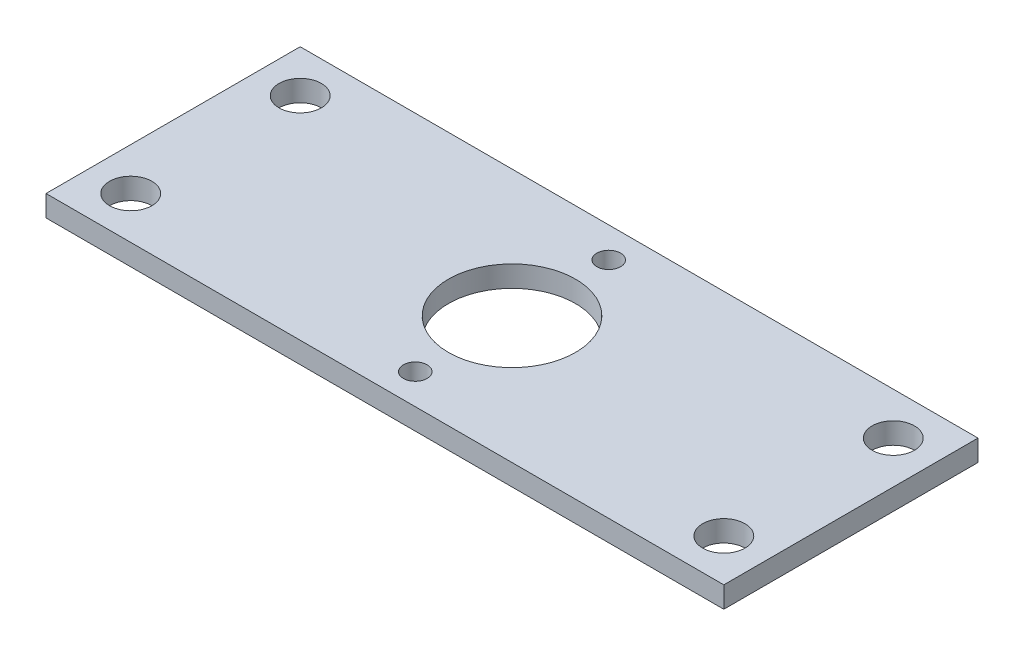
ISO-10303-21;
HEADER;
FILE_DESCRIPTION(('STEP AP214'),'2;1');
FILE_NAME('part.step','',(''),(''),'','','');
FILE_SCHEMA(('AUTOMOTIVE_DESIGN { 1 0 10303 214 1 1 1 1 }'));
ENDSEC;
DATA;
#1=APPLICATION_CONTEXT('core data for automotive mechanical design processes');
#2=APPLICATION_PROTOCOL_DEFINITION('international standard','automotive_design',2000,#1);
#3=PRODUCT_CONTEXT('',#1,'mechanical');
#4=PRODUCT('Part','Part','',(#3));
#5=PRODUCT_RELATED_PRODUCT_CATEGORY('part','',(#4));
#6=PRODUCT_DEFINITION_FORMATION('','',#4);
#7=PRODUCT_DEFINITION_CONTEXT('part definition',#1,'design');
#8=PRODUCT_DEFINITION('design','',#6,#7);
#9=PRODUCT_DEFINITION_SHAPE('','',#8);
#10=(LENGTH_UNIT() NAMED_UNIT(*) SI_UNIT(.MILLI.,.METRE.));
#11=(NAMED_UNIT(*) PLANE_ANGLE_UNIT() SI_UNIT($,.RADIAN.));
#12=(NAMED_UNIT(*) SI_UNIT($,.STERADIAN.) SOLID_ANGLE_UNIT());
#13=UNCERTAINTY_MEASURE_WITH_UNIT(LENGTH_MEASURE(1.E-05),#10,'distance_accuracy_value','');
#14=(GEOMETRIC_REPRESENTATION_CONTEXT(3) GLOBAL_UNCERTAINTY_ASSIGNED_CONTEXT((#13)) GLOBAL_UNIT_ASSIGNED_CONTEXT((#10,
#11,#12)) REPRESENTATION_CONTEXT('',''));
#15=CARTESIAN_POINT('',(0.,0.,0.));
#16=DIRECTION('',(0.,0.,1.));
#17=DIRECTION('',(1.,0.,0.));
#18=AXIS2_PLACEMENT_3D('',#15,#16,#17);
#19=CARTESIAN_POINT('',(-12.7,3.175,-19.05));
#20=DIRECTION('',(0.,0.,1.));
#21=DIRECTION('',(1.,0.,0.));
#22=AXIS2_PLACEMENT_3D('',#19,#20,#21);
#23=PLANE('',#22);
#24=DIRECTION('',(-1.,0.,0.));
#25=VECTOR('',#24,1.);
#26=CARTESIAN_POINT('',(-12.7,0.,-19.05));
#27=LINE('',#26,#25);
#28=CARTESIAN_POINT('',(50.8,0.,-19.05));
#29=VERTEX_POINT('',#28);
#30=CARTESIAN_POINT('',(-50.8,0.,-19.05));
#31=VERTEX_POINT('',#30);
#32=EDGE_CURVE('E81',#29,#31,#27,.T.);
#33=ORIENTED_EDGE('',*,*,#32,.T.);
#34=DIRECTION('',(0.,-1.,0.));
#35=VECTOR('',#34,1.);
#36=CARTESIAN_POINT('',(-50.8,0.,-19.05));
#37=LINE('',#36,#35);
#38=CARTESIAN_POINT('',(-50.8,3.175,-19.05));
#39=VERTEX_POINT('',#38);
#40=EDGE_CURVE('E102',#39,#31,#37,.T.);
#41=ORIENTED_EDGE('',*,*,#40,.F.);
#42=DIRECTION('',(-1.,0.,0.));
#43=VECTOR('',#42,1.);
#44=CARTESIAN_POINT('',(-12.7,3.175,-19.05));
#45=LINE('',#44,#43);
#46=CARTESIAN_POINT('',(50.8,3.175,-19.05));
#47=VERTEX_POINT('',#46);
#48=EDGE_CURVE('E43',#47,#39,#45,.T.);
#49=ORIENTED_EDGE('',*,*,#48,.F.);
#50=DIRECTION('',(0.,1.,0.));
#51=VECTOR('',#50,1.);
#52=CARTESIAN_POINT('',(50.8,0.,-19.05));
#53=LINE('',#52,#51);
#54=EDGE_CURVE('E88',#29,#47,#53,.T.);
#55=ORIENTED_EDGE('',*,*,#54,.F.);
#56=EDGE_LOOP('',(#33,#41,#49,#55));
#57=FACE_BOUND('',#56,.T.);
#58=ADVANCED_FACE('F35',(#57),#23,.F.);
#59=CARTESIAN_POINT('',(-12.7,3.175,19.05));
#60=DIRECTION('',(0.,0.,-1.));
#61=DIRECTION('',(-1.,0.,0.));
#62=AXIS2_PLACEMENT_3D('',#59,#60,#61);
#63=PLANE('',#62);
#64=DIRECTION('',(1.,0.,0.));
#65=VECTOR('',#64,1.);
#66=CARTESIAN_POINT('',(-12.7,0.,19.05));
#67=LINE('',#66,#65);
#68=CARTESIAN_POINT('',(-50.8,0.,19.05));
#69=VERTEX_POINT('',#68);
#70=CARTESIAN_POINT('',(50.8,0.,19.05));
#71=VERTEX_POINT('',#70);
#72=EDGE_CURVE('E38',#69,#71,#67,.T.);
#73=ORIENTED_EDGE('',*,*,#72,.T.);
#74=DIRECTION('',(0.,-1.,0.));
#75=VECTOR('',#74,1.);
#76=CARTESIAN_POINT('',(50.8,0.,19.05));
#77=LINE('',#76,#75);
#78=CARTESIAN_POINT('',(50.8,3.175,19.05));
#79=VERTEX_POINT('',#78);
#80=EDGE_CURVE('E76',#79,#71,#77,.T.);
#81=ORIENTED_EDGE('',*,*,#80,.F.);
#82=DIRECTION('',(1.,0.,0.));
#83=VECTOR('',#82,1.);
#84=CARTESIAN_POINT('',(-12.7,3.175,19.05));
#85=LINE('',#84,#83);
#86=CARTESIAN_POINT('',(-50.8,3.175,19.05));
#87=VERTEX_POINT('',#86);
#88=EDGE_CURVE('E11',#87,#79,#85,.T.);
#89=ORIENTED_EDGE('',*,*,#88,.F.);
#90=DIRECTION('',(0.,1.,0.));
#91=VECTOR('',#90,1.);
#92=CARTESIAN_POINT('',(-50.8,0.,19.05));
#93=LINE('',#92,#91);
#94=EDGE_CURVE('E77',#69,#87,#93,.T.);
#95=ORIENTED_EDGE('',*,*,#94,.F.);
#96=EDGE_LOOP('',(#73,#81,#89,#95));
#97=FACE_BOUND('',#96,.T.);
#98=ADVANCED_FACE('F74',(#97),#63,.F.);
#99=CARTESIAN_POINT('',(0.,3.175,0.));
#100=DIRECTION('',(0.,1.,0.));
#101=DIRECTION('',(0.,0.,1.));
#102=AXIS2_PLACEMENT_3D('',#99,#100,#101);
#103=PLANE('',#102);
#104=CARTESIAN_POINT('',(-44.45,3.175,12.7));
#105=DIRECTION('',(0.,1.,0.));
#106=DIRECTION('',(0.,0.,1.));
#107=AXIS2_PLACEMENT_3D('',#104,#105,#106);
#108=CIRCLE('',#107,3.175);
#109=CARTESIAN_POINT('',(-44.45,3.175,15.875));
#110=VERTEX_POINT('',#109);
#111=EDGE_CURVE('E297',#110,#110,#108,.T.);
#112=ORIENTED_EDGE('',*,*,#111,.F.);
#113=EDGE_LOOP('',(#112));
#114=FACE_BOUND('',#113,.T.);
#115=CARTESIAN_POINT('',(44.45,3.175,12.7));
#116=DIRECTION('',(0.,1.,0.));
#117=DIRECTION('',(0.,0.,1.));
#118=AXIS2_PLACEMENT_3D('',#115,#116,#117);
#119=CIRCLE('',#118,3.175);
#120=CARTESIAN_POINT('',(44.45,3.175,15.875));
#121=VERTEX_POINT('',#120);
#122=EDGE_CURVE('E302',#121,#121,#119,.T.);
#123=ORIENTED_EDGE('',*,*,#122,.F.);
#124=EDGE_LOOP('',(#123));
#125=FACE_BOUND('',#124,.T.);
#126=CARTESIAN_POINT('',(44.45,3.175,-12.7));
#127=DIRECTION('',(0.,1.,0.));
#128=DIRECTION('',(0.,0.,1.));
#129=AXIS2_PLACEMENT_3D('',#126,#127,#128);
#130=CIRCLE('',#129,3.175);
#131=CARTESIAN_POINT('',(44.45,3.175,-9.52499999999997));
#132=VERTEX_POINT('',#131);
#133=EDGE_CURVE('E310',#132,#132,#130,.T.);
#134=ORIENTED_EDGE('',*,*,#133,.F.);
#135=EDGE_LOOP('',(#134));
#136=FACE_BOUND('',#135,.T.);
#137=CARTESIAN_POINT('',(-44.45,3.175,-12.7));
#138=DIRECTION('',(0.,1.,0.));
#139=DIRECTION('',(0.,0.,1.));
#140=AXIS2_PLACEMENT_3D('',#137,#138,#139);
#141=CIRCLE('',#140,3.175);
#142=CARTESIAN_POINT('',(-44.45,3.175,-9.52499999999997));
#143=VERTEX_POINT('',#142);
#144=EDGE_CURVE('E96',#143,#143,#141,.T.);
#145=ORIENTED_EDGE('',*,*,#144,.F.);
#146=EDGE_LOOP('',(#145));
#147=FACE_BOUND('',#146,.T.);
#148=CARTESIAN_POINT('',(0.,3.175,14.5000000000001));
#149=DIRECTION('',(0.,1.,0.));
#150=DIRECTION('',(0.,0.,1.));
#151=AXIS2_PLACEMENT_3D('',#148,#149,#150);
#152=CIRCLE('',#151,1.77800000000003);
#153=CARTESIAN_POINT('',(0.,3.175,16.2780000000001));
#154=VERTEX_POINT('',#153);
#155=EDGE_CURVE('E115',#154,#154,#152,.T.);
#156=ORIENTED_EDGE('',*,*,#155,.F.);
#157=EDGE_LOOP('',(#156));
#158=FACE_BOUND('',#157,.T.);
#159=CARTESIAN_POINT('',(0.,3.175,-14.5));
#160=DIRECTION('',(0.,1.,0.));
#161=DIRECTION('',(0.,0.,1.));
#162=AXIS2_PLACEMENT_3D('',#159,#160,#161);
#163=CIRCLE('',#162,1.778);
#164=CARTESIAN_POINT('',(0.,3.175,-12.722));
#165=VERTEX_POINT('',#164);
#166=EDGE_CURVE('E110',#165,#165,#163,.T.);
#167=ORIENTED_EDGE('',*,*,#166,.F.);
#168=EDGE_LOOP('',(#167));
#169=FACE_BOUND('',#168,.T.);
#170=CARTESIAN_POINT('',(0.,3.175,0.));
#171=DIRECTION('',(0.,1.,0.));
#172=DIRECTION('',(0.,0.,1.));
#173=AXIS2_PLACEMENT_3D('',#170,#171,#172);
#174=CIRCLE('',#173,9.525);
#175=CARTESIAN_POINT('',(0.,3.175,9.525));
#176=VERTEX_POINT('',#175);
#177=EDGE_CURVE('E114',#176,#176,#174,.T.);
#178=ORIENTED_EDGE('',*,*,#177,.F.);
#179=EDGE_LOOP('',(#178));
#180=FACE_BOUND('',#179,.T.);
#181=ORIENTED_EDGE('',*,*,#88,.T.);
#182=DIRECTION('',(0.,0.,1.));
#183=VECTOR('',#182,1.);
#184=CARTESIAN_POINT('',(50.8,3.175,19.05));
#185=LINE('',#184,#183);
#186=EDGE_CURVE('E92',#47,#79,#185,.T.);
#187=ORIENTED_EDGE('',*,*,#186,.F.);
#188=ORIENTED_EDGE('',*,*,#48,.T.);
#189=DIRECTION('',(0.,0.,-1.));
#190=VECTOR('',#189,1.);
#191=CARTESIAN_POINT('',(-50.8,3.175,-19.05));
#192=LINE('',#191,#190);
#193=EDGE_CURVE('E108',#87,#39,#192,.T.);
#194=ORIENTED_EDGE('',*,*,#193,.F.);
#195=EDGE_LOOP('',(#181,#187,#188,#194));
#196=FACE_BOUND('',#195,.T.);
#197=ADVANCED_FACE('F132',(#114,#125,#136,#147,#158,#169,#180,#196),#103,.T.);
#198=CARTESIAN_POINT('',(0.,0.,0.));
#199=DIRECTION('',(0.,1.,0.));
#200=DIRECTION('',(0.,0.,1.));
#201=AXIS2_PLACEMENT_3D('',#198,#199,#200);
#202=PLANE('',#201);
#203=CARTESIAN_POINT('',(-44.45,0.,12.7));
#204=DIRECTION('',(0.,1.,0.));
#205=DIRECTION('',(0.,0.,1.));
#206=AXIS2_PLACEMENT_3D('',#203,#204,#205);
#207=CIRCLE('',#206,3.175);
#208=CARTESIAN_POINT('',(-44.45,0.,15.875));
#209=VERTEX_POINT('',#208);
#210=EDGE_CURVE('E295',#209,#209,#207,.T.);
#211=ORIENTED_EDGE('',*,*,#210,.T.);
#212=EDGE_LOOP('',(#211));
#213=FACE_BOUND('',#212,.T.);
#214=CARTESIAN_POINT('',(44.45,0.,12.7));
#215=DIRECTION('',(0.,1.,0.));
#216=DIRECTION('',(0.,0.,1.));
#217=AXIS2_PLACEMENT_3D('',#214,#215,#216);
#218=CIRCLE('',#217,3.175);
#219=CARTESIAN_POINT('',(44.45,0.,15.875));
#220=VERTEX_POINT('',#219);
#221=EDGE_CURVE('E298',#220,#220,#218,.T.);
#222=ORIENTED_EDGE('',*,*,#221,.T.);
#223=EDGE_LOOP('',(#222));
#224=FACE_BOUND('',#223,.T.);
#225=CARTESIAN_POINT('',(44.45,0.,-12.7));
#226=DIRECTION('',(0.,1.,0.));
#227=DIRECTION('',(0.,0.,1.));
#228=AXIS2_PLACEMENT_3D('',#225,#226,#227);
#229=CIRCLE('',#228,3.175);
#230=CARTESIAN_POINT('',(44.45,0.,-9.52499999999997));
#231=VERTEX_POINT('',#230);
#232=EDGE_CURVE('E307',#231,#231,#229,.T.);
#233=ORIENTED_EDGE('',*,*,#232,.T.);
#234=EDGE_LOOP('',(#233));
#235=FACE_BOUND('',#234,.T.);
#236=CARTESIAN_POINT('',(-44.45,0.,-12.7));
#237=DIRECTION('',(0.,1.,0.));
#238=DIRECTION('',(0.,0.,1.));
#239=AXIS2_PLACEMENT_3D('',#236,#237,#238);
#240=CIRCLE('',#239,3.175);
#241=CARTESIAN_POINT('',(-44.45,0.,-9.52499999999997));
#242=VERTEX_POINT('',#241);
#243=EDGE_CURVE('E93',#242,#242,#240,.T.);
#244=ORIENTED_EDGE('',*,*,#243,.T.);
#245=EDGE_LOOP('',(#244));
#246=FACE_BOUND('',#245,.T.);
#247=CARTESIAN_POINT('',(0.,0.,14.5000000000001));
#248=DIRECTION('',(0.,1.,0.));
#249=DIRECTION('',(0.,0.,1.));
#250=AXIS2_PLACEMENT_3D('',#247,#248,#249);
#251=CIRCLE('',#250,1.77800000000003);
#252=CARTESIAN_POINT('',(0.,0.,16.2780000000001));
#253=VERTEX_POINT('',#252);
#254=EDGE_CURVE('E111',#253,#253,#251,.T.);
#255=ORIENTED_EDGE('',*,*,#254,.T.);
#256=EDGE_LOOP('',(#255));
#257=FACE_BOUND('',#256,.T.);
#258=CARTESIAN_POINT('',(0.,0.,-14.5));
#259=DIRECTION('',(0.,1.,0.));
#260=DIRECTION('',(0.,0.,1.));
#261=AXIS2_PLACEMENT_3D('',#258,#259,#260);
#262=CIRCLE('',#261,1.778);
#263=CARTESIAN_POINT('',(0.,0.,-12.722));
#264=VERTEX_POINT('',#263);
#265=EDGE_CURVE('E118',#264,#264,#262,.T.);
#266=ORIENTED_EDGE('',*,*,#265,.T.);
#267=EDGE_LOOP('',(#266));
#268=FACE_BOUND('',#267,.T.);
#269=CARTESIAN_POINT('',(0.,0.,0.));
#270=DIRECTION('',(0.,1.,0.));
#271=DIRECTION('',(0.,0.,1.));
#272=AXIS2_PLACEMENT_3D('',#269,#270,#271);
#273=CIRCLE('',#272,9.525);
#274=CARTESIAN_POINT('',(0.,0.,9.525));
#275=VERTEX_POINT('',#274);
#276=EDGE_CURVE('E123',#275,#275,#273,.T.);
#277=ORIENTED_EDGE('',*,*,#276,.T.);
#278=EDGE_LOOP('',(#277));
#279=FACE_BOUND('',#278,.T.);
#280=ORIENTED_EDGE('',*,*,#32,.F.);
#281=DIRECTION('',(0.,0.,-1.));
#282=VECTOR('',#281,1.);
#283=CARTESIAN_POINT('',(50.8,0.,19.05));
#284=LINE('',#283,#282);
#285=EDGE_CURVE('E83',#71,#29,#284,.T.);
#286=ORIENTED_EDGE('',*,*,#285,.F.);
#287=ORIENTED_EDGE('',*,*,#72,.F.);
#288=DIRECTION('',(0.,0.,1.));
#289=VECTOR('',#288,1.);
#290=CARTESIAN_POINT('',(-50.8,0.,-19.05));
#291=LINE('',#290,#289);
#292=EDGE_CURVE('E105',#31,#69,#291,.T.);
#293=ORIENTED_EDGE('',*,*,#292,.F.);
#294=EDGE_LOOP('',(#280,#286,#287,#293));
#295=FACE_BOUND('',#294,.T.);
#296=ADVANCED_FACE('F84',(#213,#224,#235,#246,#257,#268,#279,#295),#202,.F.);
#297=CARTESIAN_POINT('',(0.,0.,0.));
#298=DIRECTION('',(0.,1.,0.));
#299=DIRECTION('',(0.,0.,1.));
#300=AXIS2_PLACEMENT_3D('',#297,#298,#299);
#301=CYLINDRICAL_SURFACE('',#300,9.525);
#302=ORIENTED_EDGE('',*,*,#276,.F.);
#303=EDGE_LOOP('',(#302));
#304=FACE_BOUND('',#303,.T.);
#305=ORIENTED_EDGE('',*,*,#177,.T.);
#306=EDGE_LOOP('',(#305));
#307=FACE_BOUND('',#306,.T.);
#308=ADVANCED_FACE('F140',(#304,#307),#301,.F.);
#309=CARTESIAN_POINT('',(0.,0.,-14.5));
#310=DIRECTION('',(0.,1.,0.));
#311=DIRECTION('',(0.,0.,1.));
#312=AXIS2_PLACEMENT_3D('',#309,#310,#311);
#313=CYLINDRICAL_SURFACE('',#312,1.778);
#314=ORIENTED_EDGE('',*,*,#265,.F.);
#315=EDGE_LOOP('',(#314));
#316=FACE_BOUND('',#315,.T.);
#317=ORIENTED_EDGE('',*,*,#166,.T.);
#318=EDGE_LOOP('',(#317));
#319=FACE_BOUND('',#318,.T.);
#320=ADVANCED_FACE('F228',(#316,#319),#313,.F.);
#321=CARTESIAN_POINT('',(0.,0.,14.5000000000001));
#322=DIRECTION('',(0.,1.,0.));
#323=DIRECTION('',(0.,0.,1.));
#324=AXIS2_PLACEMENT_3D('',#321,#322,#323);
#325=CYLINDRICAL_SURFACE('',#324,1.77800000000003);
#326=ORIENTED_EDGE('',*,*,#254,.F.);
#327=EDGE_LOOP('',(#326));
#328=FACE_BOUND('',#327,.T.);
#329=ORIENTED_EDGE('',*,*,#155,.T.);
#330=EDGE_LOOP('',(#329));
#331=FACE_BOUND('',#330,.T.);
#332=ADVANCED_FACE('F225',(#328,#331),#325,.F.);
#333=CARTESIAN_POINT('',(-50.8,0.,0.));
#334=DIRECTION('',(1.,0.,0.));
#335=DIRECTION('',(0.,0.,-1.));
#336=AXIS2_PLACEMENT_3D('',#333,#334,#335);
#337=PLANE('',#336);
#338=ORIENTED_EDGE('',*,*,#40,.T.);
#339=ORIENTED_EDGE('',*,*,#292,.T.);
#340=ORIENTED_EDGE('',*,*,#94,.T.);
#341=ORIENTED_EDGE('',*,*,#193,.T.);
#342=EDGE_LOOP('',(#338,#339,#340,#341));
#343=FACE_BOUND('',#342,.T.);
#344=ADVANCED_FACE('F131',(#343),#337,.F.);
#345=CARTESIAN_POINT('',(50.8,0.,0.));
#346=DIRECTION('',(-1.,0.,0.));
#347=DIRECTION('',(0.,0.,1.));
#348=AXIS2_PLACEMENT_3D('',#345,#346,#347);
#349=PLANE('',#348);
#350=ORIENTED_EDGE('',*,*,#80,.T.);
#351=ORIENTED_EDGE('',*,*,#285,.T.);
#352=ORIENTED_EDGE('',*,*,#54,.T.);
#353=ORIENTED_EDGE('',*,*,#186,.T.);
#354=EDGE_LOOP('',(#350,#351,#352,#353));
#355=FACE_BOUND('',#354,.T.);
#356=ADVANCED_FACE('F91',(#355),#349,.F.);
#357=CARTESIAN_POINT('',(-44.45,0.,-12.7));
#358=DIRECTION('',(0.,1.,0.));
#359=DIRECTION('',(0.,0.,1.));
#360=AXIS2_PLACEMENT_3D('',#357,#358,#359);
#361=CYLINDRICAL_SURFACE('',#360,3.175);
#362=ORIENTED_EDGE('',*,*,#243,.F.);
#363=EDGE_LOOP('',(#362));
#364=FACE_BOUND('',#363,.T.);
#365=ORIENTED_EDGE('',*,*,#144,.T.);
#366=EDGE_LOOP('',(#365));
#367=FACE_BOUND('',#366,.T.);
#368=ADVANCED_FACE('F164',(#364,#367),#361,.F.);
#369=CARTESIAN_POINT('',(44.45,0.,-12.7));
#370=DIRECTION('',(0.,1.,0.));
#371=DIRECTION('',(0.,0.,1.));
#372=AXIS2_PLACEMENT_3D('',#369,#370,#371);
#373=CYLINDRICAL_SURFACE('',#372,3.175);
#374=ORIENTED_EDGE('',*,*,#232,.F.);
#375=EDGE_LOOP('',(#374));
#376=FACE_BOUND('',#375,.T.);
#377=ORIENTED_EDGE('',*,*,#133,.T.);
#378=EDGE_LOOP('',(#377));
#379=FACE_BOUND('',#378,.T.);
#380=ADVANCED_FACE('F187',(#376,#379),#373,.F.);
#381=CARTESIAN_POINT('',(44.45,0.,12.7));
#382=DIRECTION('',(0.,1.,0.));
#383=DIRECTION('',(0.,0.,1.));
#384=AXIS2_PLACEMENT_3D('',#381,#382,#383);
#385=CYLINDRICAL_SURFACE('',#384,3.175);
#386=ORIENTED_EDGE('',*,*,#221,.F.);
#387=EDGE_LOOP('',(#386));
#388=FACE_BOUND('',#387,.T.);
#389=ORIENTED_EDGE('',*,*,#122,.T.);
#390=EDGE_LOOP('',(#389));
#391=FACE_BOUND('',#390,.T.);
#392=ADVANCED_FACE('F197',(#388,#391),#385,.F.);
#393=CARTESIAN_POINT('',(-44.45,0.,12.7));
#394=DIRECTION('',(0.,1.,0.));
#395=DIRECTION('',(0.,0.,1.));
#396=AXIS2_PLACEMENT_3D('',#393,#394,#395);
#397=CYLINDRICAL_SURFACE('',#396,3.175);
#398=ORIENTED_EDGE('',*,*,#210,.F.);
#399=EDGE_LOOP('',(#398));
#400=FACE_BOUND('',#399,.T.);
#401=ORIENTED_EDGE('',*,*,#111,.T.);
#402=EDGE_LOOP('',(#401));
#403=FACE_BOUND('',#402,.T.);
#404=ADVANCED_FACE('F207',(#400,#403),#397,.F.);
#405=CLOSED_SHELL('',(#58,#98,#197,#296,#308,#320,#332,#344,#356,#368,#380,#392,#404));
#406=MANIFOLD_SOLID_BREP('B2',#405);
#407=ADVANCED_BREP_SHAPE_REPRESENTATION('',(#18,#406),#14);
#408=SHAPE_DEFINITION_REPRESENTATION(#9,#407);
ENDSEC;
END-ISO-10303-21;
